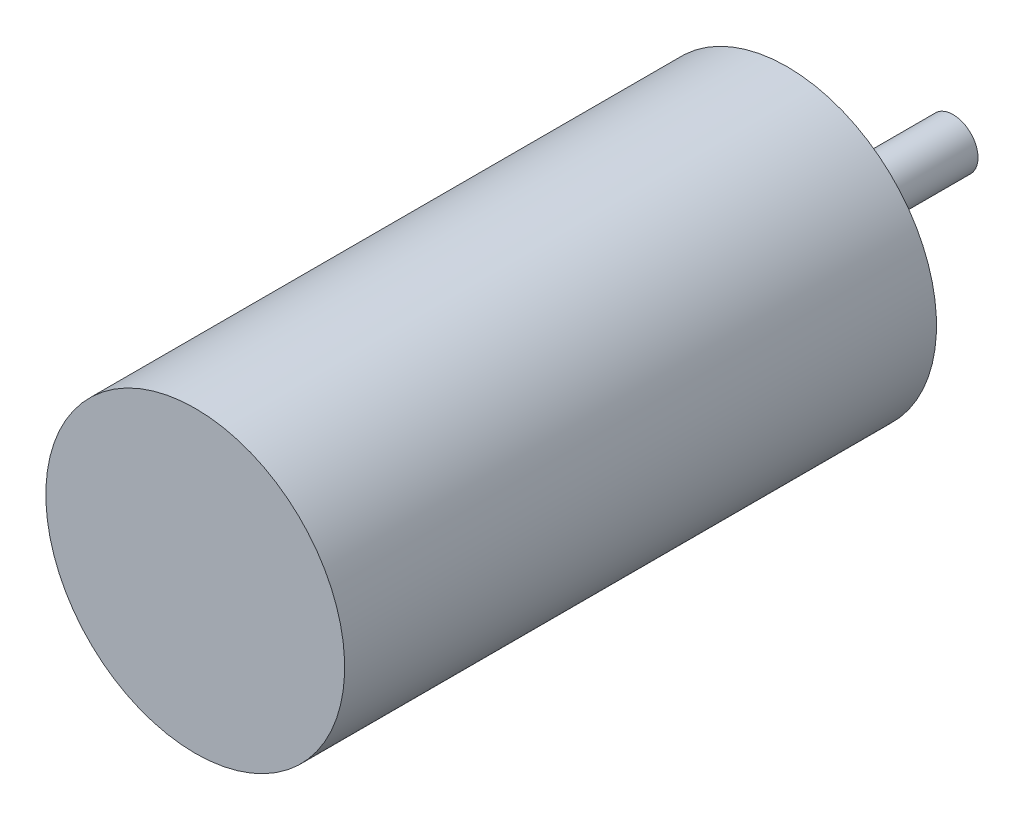
ISO-10303-21;
HEADER;
FILE_DESCRIPTION(('STEP AP214'),'2;1');
FILE_NAME('part.step','',(''),(''),'','','');
FILE_SCHEMA(('AUTOMOTIVE_DESIGN { 1 0 10303 214 1 1 1 1 }'));
ENDSEC;
DATA;
#1=APPLICATION_CONTEXT('core data for automotive mechanical design processes');
#2=APPLICATION_PROTOCOL_DEFINITION('international standard','automotive_design',2000,#1);
#3=PRODUCT_CONTEXT('',#1,'mechanical');
#4=PRODUCT('Part','Part','',(#3));
#5=PRODUCT_RELATED_PRODUCT_CATEGORY('part','',(#4));
#6=PRODUCT_DEFINITION_FORMATION('','',#4);
#7=PRODUCT_DEFINITION_CONTEXT('part definition',#1,'design');
#8=PRODUCT_DEFINITION('design','',#6,#7);
#9=PRODUCT_DEFINITION_SHAPE('','',#8);
#10=(LENGTH_UNIT() NAMED_UNIT(*) SI_UNIT(.MILLI.,.METRE.));
#11=(NAMED_UNIT(*) PLANE_ANGLE_UNIT() SI_UNIT($,.RADIAN.));
#12=(NAMED_UNIT(*) SI_UNIT($,.STERADIAN.) SOLID_ANGLE_UNIT());
#13=UNCERTAINTY_MEASURE_WITH_UNIT(LENGTH_MEASURE(1.E-05),#10,'distance_accuracy_value','');
#14=(GEOMETRIC_REPRESENTATION_CONTEXT(3) GLOBAL_UNCERTAINTY_ASSIGNED_CONTEXT((#13)) GLOBAL_UNIT_ASSIGNED_CONTEXT((#10,
#11,#12)) REPRESENTATION_CONTEXT('',''));
#15=CARTESIAN_POINT('',(0.,0.,0.));
#16=DIRECTION('',(0.,0.,1.));
#17=DIRECTION('',(1.,0.,0.));
#18=AXIS2_PLACEMENT_3D('',#15,#16,#17);
#19=CARTESIAN_POINT('',(0.,0.,0.));
#20=DIRECTION('',(0.,0.,1.));
#21=DIRECTION('',(0.,-1.,0.));
#22=AXIS2_PLACEMENT_3D('',#19,#20,#21);
#23=PLANE('',#22);
#24=CARTESIAN_POINT('',(0.,0.,0.));
#25=DIRECTION('',(0.,0.,-1.));
#26=DIRECTION('',(0.,1.,0.));
#27=AXIS2_PLACEMENT_3D('',#24,#25,#26);
#28=CIRCLE('',#27,18.);
#29=CARTESIAN_POINT('',(0.,18.,0.));
#30=VERTEX_POINT('',#29);
#31=EDGE_CURVE('E10',#30,#30,#28,.T.);
#32=ORIENTED_EDGE('',*,*,#31,.F.);
#33=EDGE_LOOP('',(#32));
#34=FACE_BOUND('',#33,.T.);
#35=ADVANCED_FACE('F37',(#34),#23,.T.);
#36=CARTESIAN_POINT('',(0.,0.,-91.3));
#37=DIRECTION('',(0.,0.,-1.));
#38=DIRECTION('',(0.,1.,0.));
#39=AXIS2_PLACEMENT_3D('',#36,#37,#38);
#40=CYLINDRICAL_SURFACE('',#39,18.);
#41=ORIENTED_EDGE('',*,*,#31,.T.);
#42=EDGE_LOOP('',(#41));
#43=FACE_BOUND('',#42,.T.);
#44=CARTESIAN_POINT('',(0.,0.,-71.3));
#45=DIRECTION('',(0.,0.,-1.));
#46=DIRECTION('',(0.,1.,0.));
#47=AXIS2_PLACEMENT_3D('',#44,#45,#46);
#48=CIRCLE('',#47,18.);
#49=CARTESIAN_POINT('',(0.,18.,-71.3));
#50=VERTEX_POINT('',#49);
#51=EDGE_CURVE('E43',#50,#50,#48,.T.);
#52=ORIENTED_EDGE('',*,*,#51,.F.);
#53=EDGE_LOOP('',(#52));
#54=FACE_BOUND('',#53,.T.);
#55=ADVANCED_FACE('F118',(#43,#54),#40,.T.);
#56=CARTESIAN_POINT('',(0.,18.,-71.3));
#57=DIRECTION('',(0.,0.,-1.));
#58=DIRECTION('',(0.,1.,0.));
#59=AXIS2_PLACEMENT_3D('',#56,#57,#58);
#60=PLANE('',#59);
#61=CARTESIAN_POINT('',(0.,9.5,-71.3));
#62=DIRECTION('',(0.,0.,-1.));
#63=DIRECTION('',(0.,1.,0.));
#64=AXIS2_PLACEMENT_3D('',#61,#62,#63);
#65=CIRCLE('',#64,1.25);
#66=CARTESIAN_POINT('',(0.,10.75,-71.3));
#67=VERTEX_POINT('',#66);
#68=EDGE_CURVE('E94',#67,#67,#65,.T.);
#69=ORIENTED_EDGE('',*,*,#68,.F.);
#70=EDGE_LOOP('',(#69));
#71=FACE_BOUND('',#70,.T.);
#72=CARTESIAN_POINT('',(8.2272413359519,4.74999999999953,-71.3));
#73=DIRECTION('',(0.,0.,-1.));
#74=DIRECTION('',(0.,1.,0.));
#75=AXIS2_PLACEMENT_3D('',#72,#73,#74);
#76=CIRCLE('',#75,1.25000000000051);
#77=CARTESIAN_POINT('',(8.2272413359519,6.00000000000004,-71.3));
#78=VERTEX_POINT('',#77);
#79=EDGE_CURVE('E73',#78,#78,#76,.T.);
#80=ORIENTED_EDGE('',*,*,#79,.F.);
#81=EDGE_LOOP('',(#80));
#82=FACE_BOUND('',#81,.T.);
#83=CARTESIAN_POINT('',(8.22724133595136,-4.75000000000047,-71.3));
#84=DIRECTION('',(0.,0.,-1.));
#85=DIRECTION('',(0.,1.,0.));
#86=AXIS2_PLACEMENT_3D('',#83,#84,#85);
#87=CIRCLE('',#86,1.250000000001);
#88=CARTESIAN_POINT('',(8.22724133595136,-3.49999999999947,-71.3));
#89=VERTEX_POINT('',#88);
#90=EDGE_CURVE('E72',#89,#89,#87,.T.);
#91=ORIENTED_EDGE('',*,*,#90,.F.);
#92=EDGE_LOOP('',(#91));
#93=FACE_BOUND('',#92,.T.);
#94=CARTESIAN_POINT('',(-1.07653471497778E-12,-9.5,-71.3));
#95=DIRECTION('',(0.,0.,-1.));
#96=DIRECTION('',(0.,1.,0.));
#97=AXIS2_PLACEMENT_3D('',#94,#95,#96);
#98=CIRCLE('',#97,1.25000000000109);
#99=CARTESIAN_POINT('',(-1.07653471497778E-12,-8.2499999999989,-71.3));
#100=VERTEX_POINT('',#99);
#101=EDGE_CURVE('E79',#100,#100,#98,.T.);
#102=ORIENTED_EDGE('',*,*,#101,.F.);
#103=EDGE_LOOP('',(#102));
#104=FACE_BOUND('',#103,.T.);
#105=CARTESIAN_POINT('',(-8.22724133595298,-4.74999999999953,-71.3));
#106=DIRECTION('',(0.,0.,-1.));
#107=DIRECTION('',(0.,1.,0.));
#108=AXIS2_PLACEMENT_3D('',#105,#106,#107);
#109=CIRCLE('',#108,1.25000000000068);
#110=CARTESIAN_POINT('',(-8.22724133595298,-3.49999999999885,-71.3));
#111=VERTEX_POINT('',#110);
#112=EDGE_CURVE('E85',#111,#111,#109,.T.);
#113=ORIENTED_EDGE('',*,*,#112,.F.);
#114=EDGE_LOOP('',(#113));
#115=FACE_BOUND('',#114,.T.);
#116=CARTESIAN_POINT('',(-8.22724133595243,4.75000000000047,-71.3));
#117=DIRECTION('',(0.,0.,-1.));
#118=DIRECTION('',(0.,1.,0.));
#119=AXIS2_PLACEMENT_3D('',#116,#117,#118);
#120=CIRCLE('',#119,1.25000000000014);
#121=CARTESIAN_POINT('',(-8.22724133595243,6.00000000000062,-71.3));
#122=VERTEX_POINT('',#121);
#123=EDGE_CURVE('E91',#122,#122,#120,.T.);
#124=ORIENTED_EDGE('',*,*,#123,.F.);
#125=EDGE_LOOP('',(#124));
#126=FACE_BOUND('',#125,.T.);
#127=ORIENTED_EDGE('',*,*,#51,.T.);
#128=EDGE_LOOP('',(#127));
#129=FACE_BOUND('',#128,.T.);
#130=CARTESIAN_POINT('',(0.,0.,-71.3));
#131=DIRECTION('',(0.,0.,-1.));
#132=DIRECTION('',(0.,1.,0.));
#133=AXIS2_PLACEMENT_3D('',#130,#131,#132);
#134=CIRCLE('',#133,6.49999999999999);
#135=CARTESIAN_POINT('',(0.,6.5,-71.3));
#136=VERTEX_POINT('',#135);
#137=EDGE_CURVE('E47',#136,#136,#134,.T.);
#138=ORIENTED_EDGE('',*,*,#137,.F.);
#139=EDGE_LOOP('',(#138));
#140=FACE_BOUND('',#139,.T.);
#141=ADVANCED_FACE('F114',(#71,#82,#93,#104,#115,#126,#129,#140),#60,.T.);
#142=CARTESIAN_POINT('',(0.,0.,-91.3));
#143=DIRECTION('',(0.,0.,-1.));
#144=DIRECTION('',(0.,1.,0.));
#145=AXIS2_PLACEMENT_3D('',#142,#143,#144);
#146=CYLINDRICAL_SURFACE('',#145,6.49999999999999);
#147=ORIENTED_EDGE('',*,*,#137,.T.);
#148=EDGE_LOOP('',(#147));
#149=FACE_BOUND('',#148,.T.);
#150=CARTESIAN_POINT('',(0.,0.,-72.5));
#151=DIRECTION('',(0.,0.,-1.));
#152=DIRECTION('',(0.,1.,0.));
#153=AXIS2_PLACEMENT_3D('',#150,#151,#152);
#154=CIRCLE('',#153,6.49999999999999);
#155=CARTESIAN_POINT('',(0.,6.5,-72.5));
#156=VERTEX_POINT('',#155);
#157=EDGE_CURVE('E51',#156,#156,#154,.T.);
#158=ORIENTED_EDGE('',*,*,#157,.F.);
#159=EDGE_LOOP('',(#158));
#160=FACE_BOUND('',#159,.T.);
#161=ADVANCED_FACE('F117',(#149,#160),#146,.T.);
#162=CARTESIAN_POINT('',(0.,6.5,-72.5));
#163=DIRECTION('',(0.,0.,-1.));
#164=DIRECTION('',(0.,1.,0.));
#165=AXIS2_PLACEMENT_3D('',#162,#163,#164);
#166=PLANE('',#165);
#167=ORIENTED_EDGE('',*,*,#157,.T.);
#168=EDGE_LOOP('',(#167));
#169=FACE_BOUND('',#168,.T.);
#170=CARTESIAN_POINT('',(0.,0.,-72.5));
#171=DIRECTION('',(0.,0.,-1.));
#172=DIRECTION('',(0.,1.,0.));
#173=AXIS2_PLACEMENT_3D('',#170,#171,#172);
#174=CIRCLE('',#173,4.86363636363635);
#175=CARTESIAN_POINT('',(0.,4.86363636363636,-72.5));
#176=VERTEX_POINT('',#175);
#177=EDGE_CURVE('E56',#176,#176,#174,.T.);
#178=ORIENTED_EDGE('',*,*,#177,.F.);
#179=EDGE_LOOP('',(#178));
#180=FACE_BOUND('',#179,.T.);
#181=ADVANCED_FACE('F134',(#169,#180),#166,.T.);
#182=CARTESIAN_POINT('',(0.,0.,-91.3));
#183=DIRECTION('',(0.,0.,-1.));
#184=DIRECTION('',(0.,1.,0.));
#185=AXIS2_PLACEMENT_3D('',#182,#183,#184);
#186=CYLINDRICAL_SURFACE('',#185,4.86363636363635);
#187=ORIENTED_EDGE('',*,*,#177,.T.);
#188=EDGE_LOOP('',(#187));
#189=FACE_BOUND('',#188,.T.);
#190=CARTESIAN_POINT('',(0.,0.,-74.65));
#191=DIRECTION('',(0.,0.,-1.));
#192=DIRECTION('',(0.,1.,0.));
#193=AXIS2_PLACEMENT_3D('',#190,#191,#192);
#194=CIRCLE('',#193,4.86363636363635);
#195=CARTESIAN_POINT('',(0.,4.86363636363636,-74.65));
#196=VERTEX_POINT('',#195);
#197=EDGE_CURVE('E59',#196,#196,#194,.T.);
#198=ORIENTED_EDGE('',*,*,#197,.F.);
#199=EDGE_LOOP('',(#198));
#200=FACE_BOUND('',#199,.T.);
#201=ADVANCED_FACE('F140',(#189,#200),#186,.T.);
#202=CARTESIAN_POINT('',(0.,4.86363636363636,-74.65));
#203=DIRECTION('',(0.,0.,-1.));
#204=DIRECTION('',(0.,1.,0.));
#205=AXIS2_PLACEMENT_3D('',#202,#203,#204);
#206=PLANE('',#205);
#207=ORIENTED_EDGE('',*,*,#197,.T.);
#208=EDGE_LOOP('',(#207));
#209=FACE_BOUND('',#208,.T.);
#210=CARTESIAN_POINT('',(0.,0.,-74.65));
#211=DIRECTION('',(0.,0.,-1.));
#212=DIRECTION('',(0.,1.,0.));
#213=AXIS2_PLACEMENT_3D('',#210,#211,#212);
#214=CIRCLE('',#213,2.99999999999999);
#215=CARTESIAN_POINT('',(0.,3.,-74.65));
#216=VERTEX_POINT('',#215);
#217=EDGE_CURVE('E62',#216,#216,#214,.T.);
#218=ORIENTED_EDGE('',*,*,#217,.F.);
#219=EDGE_LOOP('',(#218));
#220=FACE_BOUND('',#219,.T.);
#221=ADVANCED_FACE('F146',(#209,#220),#206,.T.);
#222=CARTESIAN_POINT('',(0.,0.,-91.3));
#223=DIRECTION('',(0.,0.,-1.));
#224=DIRECTION('',(0.,1.,0.));
#225=AXIS2_PLACEMENT_3D('',#222,#223,#224);
#226=CYLINDRICAL_SURFACE('',#225,2.99999999999999);
#227=ORIENTED_EDGE('',*,*,#217,.T.);
#228=EDGE_LOOP('',(#227));
#229=FACE_BOUND('',#228,.T.);
#230=CARTESIAN_POINT('',(0.,0.,-91.3));
#231=DIRECTION('',(0.,0.,-1.));
#232=DIRECTION('',(0.,1.,0.));
#233=AXIS2_PLACEMENT_3D('',#230,#231,#232);
#234=CIRCLE('',#233,2.99999999999999);
#235=CARTESIAN_POINT('',(0.,3.,-91.3));
#236=VERTEX_POINT('',#235);
#237=EDGE_CURVE('E65',#236,#236,#234,.T.);
#238=ORIENTED_EDGE('',*,*,#237,.F.);
#239=EDGE_LOOP('',(#238));
#240=FACE_BOUND('',#239,.T.);
#241=ADVANCED_FACE('F152',(#229,#240),#226,.T.);
#242=CARTESIAN_POINT('',(0.,3.,-91.3));
#243=DIRECTION('',(0.,0.,-1.));
#244=DIRECTION('',(0.,1.,0.));
#245=AXIS2_PLACEMENT_3D('',#242,#243,#244);
#246=PLANE('',#245);
#247=ORIENTED_EDGE('',*,*,#237,.T.);
#248=EDGE_LOOP('',(#247));
#249=FACE_BOUND('',#248,.T.);
#250=ADVANCED_FACE('F158',(#249),#246,.T.);
#251=CARTESIAN_POINT('',(-8.22724133595243,4.75000000000047,-64.8));
#252=DIRECTION('',(0.,0.,-1.));
#253=DIRECTION('',(0.,1.,0.));
#254=AXIS2_PLACEMENT_3D('',#251,#252,#253);
#255=CYLINDRICAL_SURFACE('',#254,1.25000000000014);
#256=CARTESIAN_POINT('',(-8.22724133595243,4.75000000000047,-64.8));
#257=DIRECTION('',(0.,0.,-1.));
#258=DIRECTION('',(0.,1.,0.));
#259=AXIS2_PLACEMENT_3D('',#256,#257,#258);
#260=CIRCLE('',#259,1.25000000000014);
#261=CARTESIAN_POINT('',(-8.22724133595243,6.00000000000062,-64.8));
#262=VERTEX_POINT('',#261);
#263=EDGE_CURVE('E88',#262,#262,#260,.T.);
#264=ORIENTED_EDGE('',*,*,#263,.F.);
#265=EDGE_LOOP('',(#264));
#266=FACE_BOUND('',#265,.T.);
#267=ORIENTED_EDGE('',*,*,#123,.T.);
#268=EDGE_LOOP('',(#267));
#269=FACE_BOUND('',#268,.T.);
#270=ADVANCED_FACE('F163',(#266,#269),#255,.F.);
#271=CARTESIAN_POINT('',(-8.22724133595243,4.75000000000047,-64.8));
#272=DIRECTION('',(0.,0.,-1.));
#273=DIRECTION('',(0.,1.,0.));
#274=AXIS2_PLACEMENT_3D('',#271,#272,#273);
#275=PLANE('',#274);
#276=ORIENTED_EDGE('',*,*,#263,.T.);
#277=EDGE_LOOP('',(#276));
#278=FACE_BOUND('',#277,.T.);
#279=ADVANCED_FACE('F168',(#278),#275,.T.);
#280=CARTESIAN_POINT('',(-8.22724133595298,-4.74999999999953,-64.8));
#281=DIRECTION('',(0.,0.,-1.));
#282=DIRECTION('',(0.,1.,0.));
#283=AXIS2_PLACEMENT_3D('',#280,#281,#282);
#284=CYLINDRICAL_SURFACE('',#283,1.25000000000068);
#285=CARTESIAN_POINT('',(-8.22724133595298,-4.74999999999953,-64.8));
#286=DIRECTION('',(0.,0.,-1.));
#287=DIRECTION('',(0.,1.,0.));
#288=AXIS2_PLACEMENT_3D('',#285,#286,#287);
#289=CIRCLE('',#288,1.25000000000068);
#290=CARTESIAN_POINT('',(-8.22724133595298,-3.49999999999885,-64.8));
#291=VERTEX_POINT('',#290);
#292=EDGE_CURVE('E82',#291,#291,#289,.T.);
#293=ORIENTED_EDGE('',*,*,#292,.F.);
#294=EDGE_LOOP('',(#293));
#295=FACE_BOUND('',#294,.T.);
#296=ORIENTED_EDGE('',*,*,#112,.T.);
#297=EDGE_LOOP('',(#296));
#298=FACE_BOUND('',#297,.T.);
#299=ADVANCED_FACE('F232',(#295,#298),#284,.F.);
#300=CARTESIAN_POINT('',(-8.22724133595298,-4.74999999999953,-64.8));
#301=DIRECTION('',(0.,0.,-1.));
#302=DIRECTION('',(0.,1.,0.));
#303=AXIS2_PLACEMENT_3D('',#300,#301,#302);
#304=PLANE('',#303);
#305=ORIENTED_EDGE('',*,*,#292,.T.);
#306=EDGE_LOOP('',(#305));
#307=FACE_BOUND('',#306,.T.);
#308=ADVANCED_FACE('F243',(#307),#304,.T.);
#309=CARTESIAN_POINT('',(-1.07653471497778E-12,-9.5,-64.8));
#310=DIRECTION('',(0.,0.,-1.));
#311=DIRECTION('',(0.,1.,0.));
#312=AXIS2_PLACEMENT_3D('',#309,#310,#311);
#313=CYLINDRICAL_SURFACE('',#312,1.25000000000109);
#314=CARTESIAN_POINT('',(-1.07653471497778E-12,-9.5,-64.8));
#315=DIRECTION('',(0.,0.,-1.));
#316=DIRECTION('',(0.,1.,0.));
#317=AXIS2_PLACEMENT_3D('',#314,#315,#316);
#318=CIRCLE('',#317,1.25000000000109);
#319=CARTESIAN_POINT('',(-1.07653471497778E-12,-8.2499999999989,-64.8));
#320=VERTEX_POINT('',#319);
#321=EDGE_CURVE('E76',#320,#320,#318,.T.);
#322=ORIENTED_EDGE('',*,*,#321,.F.);
#323=EDGE_LOOP('',(#322));
#324=FACE_BOUND('',#323,.T.);
#325=ORIENTED_EDGE('',*,*,#101,.T.);
#326=EDGE_LOOP('',(#325));
#327=FACE_BOUND('',#326,.T.);
#328=ADVANCED_FACE('F254',(#324,#327),#313,.F.);
#329=CARTESIAN_POINT('',(-1.07653471497778E-12,-9.5,-64.8));
#330=DIRECTION('',(0.,0.,-1.));
#331=DIRECTION('',(0.,1.,0.));
#332=AXIS2_PLACEMENT_3D('',#329,#330,#331);
#333=PLANE('',#332);
#334=ORIENTED_EDGE('',*,*,#321,.T.);
#335=EDGE_LOOP('',(#334));
#336=FACE_BOUND('',#335,.T.);
#337=ADVANCED_FACE('F265',(#336),#333,.T.);
#338=CARTESIAN_POINT('',(8.22724133595136,-4.75000000000047,-64.8));
#339=DIRECTION('',(0.,0.,-1.));
#340=DIRECTION('',(0.,1.,0.));
#341=AXIS2_PLACEMENT_3D('',#338,#339,#340);
#342=CYLINDRICAL_SURFACE('',#341,1.250000000001);
#343=CARTESIAN_POINT('',(8.22724133595136,-4.75000000000047,-64.8));
#344=DIRECTION('',(0.,0.,-1.));
#345=DIRECTION('',(0.,1.,0.));
#346=AXIS2_PLACEMENT_3D('',#343,#344,#345);
#347=CIRCLE('',#346,1.250000000001);
#348=CARTESIAN_POINT('',(8.22724133595136,-3.49999999999947,-64.8));
#349=VERTEX_POINT('',#348);
#350=EDGE_CURVE('E69',#349,#349,#347,.T.);
#351=ORIENTED_EDGE('',*,*,#350,.F.);
#352=EDGE_LOOP('',(#351));
#353=FACE_BOUND('',#352,.T.);
#354=ORIENTED_EDGE('',*,*,#90,.T.);
#355=EDGE_LOOP('',(#354));
#356=FACE_BOUND('',#355,.T.);
#357=ADVANCED_FACE('F276',(#353,#356),#342,.F.);
#358=CARTESIAN_POINT('',(8.22724133595136,-4.75000000000047,-64.8));
#359=DIRECTION('',(0.,0.,-1.));
#360=DIRECTION('',(0.,1.,0.));
#361=AXIS2_PLACEMENT_3D('',#358,#359,#360);
#362=PLANE('',#361);
#363=ORIENTED_EDGE('',*,*,#350,.T.);
#364=EDGE_LOOP('',(#363));
#365=FACE_BOUND('',#364,.T.);
#366=ADVANCED_FACE('F287',(#365),#362,.T.);
#367=CARTESIAN_POINT('',(8.2272413359519,4.74999999999953,-64.8));
#368=DIRECTION('',(0.,0.,-1.));
#369=DIRECTION('',(0.,1.,0.));
#370=AXIS2_PLACEMENT_3D('',#367,#368,#369);
#371=CYLINDRICAL_SURFACE('',#370,1.25000000000051);
#372=CARTESIAN_POINT('',(8.2272413359519,4.74999999999953,-64.8));
#373=DIRECTION('',(0.,0.,-1.));
#374=DIRECTION('',(0.,1.,0.));
#375=AXIS2_PLACEMENT_3D('',#372,#373,#374);
#376=CIRCLE('',#375,1.25000000000051);
#377=CARTESIAN_POINT('',(8.2272413359519,6.00000000000004,-64.8));
#378=VERTEX_POINT('',#377);
#379=EDGE_CURVE('E95',#378,#378,#376,.T.);
#380=ORIENTED_EDGE('',*,*,#379,.F.);
#381=EDGE_LOOP('',(#380));
#382=FACE_BOUND('',#381,.T.);
#383=ORIENTED_EDGE('',*,*,#79,.T.);
#384=EDGE_LOOP('',(#383));
#385=FACE_BOUND('',#384,.T.);
#386=ADVANCED_FACE('F298',(#382,#385),#371,.F.);
#387=CARTESIAN_POINT('',(8.2272413359519,4.74999999999953,-64.8));
#388=DIRECTION('',(0.,0.,-1.));
#389=DIRECTION('',(0.,1.,0.));
#390=AXIS2_PLACEMENT_3D('',#387,#388,#389);
#391=PLANE('',#390);
#392=ORIENTED_EDGE('',*,*,#379,.T.);
#393=EDGE_LOOP('',(#392));
#394=FACE_BOUND('',#393,.T.);
#395=ADVANCED_FACE('F110',(#394),#391,.T.);
#396=CARTESIAN_POINT('',(0.,9.5,-64.8));
#397=DIRECTION('',(0.,0.,-1.));
#398=DIRECTION('',(0.,1.,0.));
#399=AXIS2_PLACEMENT_3D('',#396,#397,#398);
#400=CYLINDRICAL_SURFACE('',#399,1.25);
#401=CARTESIAN_POINT('',(0.,9.5,-64.8));
#402=DIRECTION('',(0.,0.,-1.));
#403=DIRECTION('',(0.,1.,0.));
#404=AXIS2_PLACEMENT_3D('',#401,#402,#403);
#405=CIRCLE('',#404,1.25);
#406=CARTESIAN_POINT('',(0.,10.75,-64.8));
#407=VERTEX_POINT('',#406);
#408=EDGE_CURVE('E68',#407,#407,#405,.T.);
#409=ORIENTED_EDGE('',*,*,#408,.F.);
#410=EDGE_LOOP('',(#409));
#411=FACE_BOUND('',#410,.T.);
#412=ORIENTED_EDGE('',*,*,#68,.T.);
#413=EDGE_LOOP('',(#412));
#414=FACE_BOUND('',#413,.T.);
#415=ADVANCED_FACE('F107',(#411,#414),#400,.F.);
#416=CARTESIAN_POINT('',(0.,9.5,-64.8));
#417=DIRECTION('',(0.,0.,-1.));
#418=DIRECTION('',(0.,1.,0.));
#419=AXIS2_PLACEMENT_3D('',#416,#417,#418);
#420=PLANE('',#419);
#421=ORIENTED_EDGE('',*,*,#408,.T.);
#422=EDGE_LOOP('',(#421));
#423=FACE_BOUND('',#422,.T.);
#424=ADVANCED_FACE('F105',(#423),#420,.T.);
#425=CLOSED_SHELL('',(#35,#55,#141,#161,#181,#201,#221,#241,#250,#270,#279,#299,#308,#328,#337,
#357,#366,#386,#395,#415,#424));
#426=MANIFOLD_SOLID_BREP('B2',#425);
#427=ADVANCED_BREP_SHAPE_REPRESENTATION('',(#18,#426),#14);
#428=SHAPE_DEFINITION_REPRESENTATION(#9,#427);
ENDSEC;
END-ISO-10303-21;
